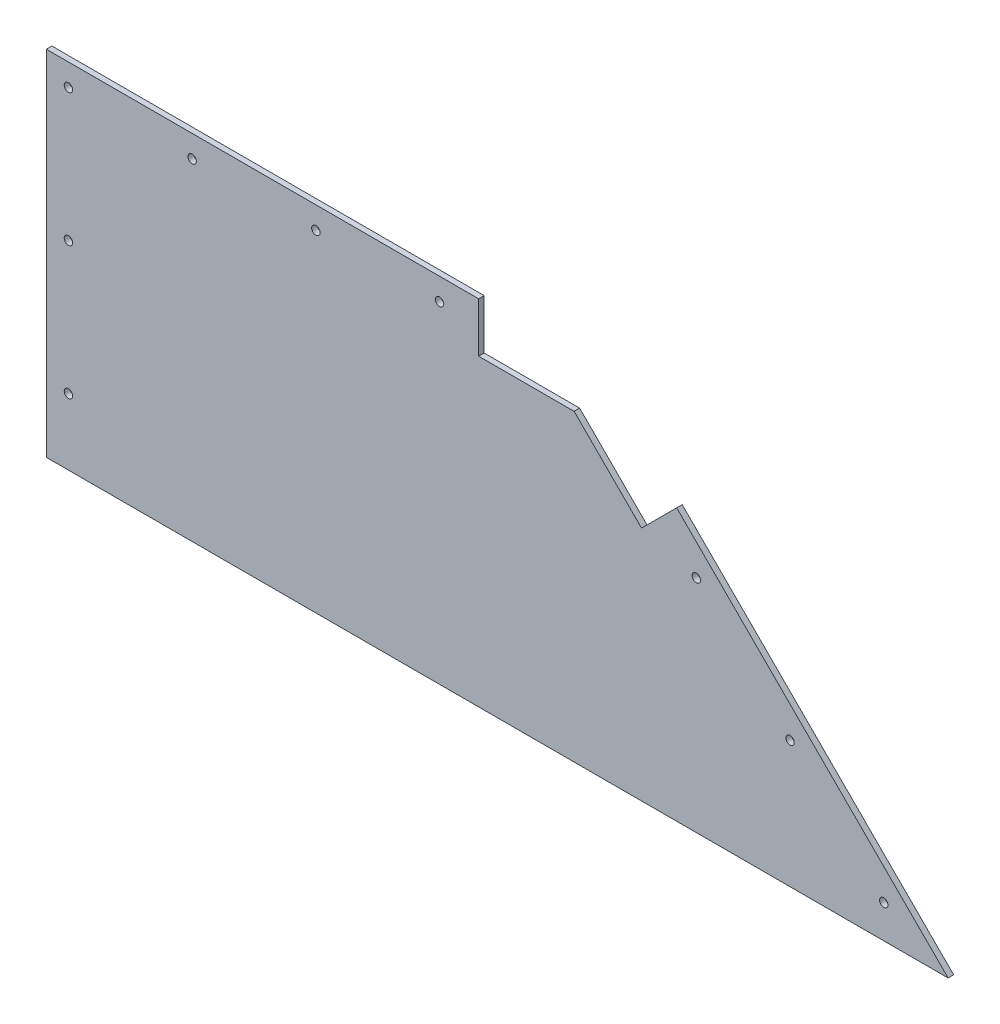
ISO-10303-21;
HEADER;
FILE_DESCRIPTION(('STEP AP214'),'2;1');
FILE_NAME('part.step','',(''),(''),'','','');
FILE_SCHEMA(('AUTOMOTIVE_DESIGN { 1 0 10303 214 1 1 1 1 }'));
ENDSEC;
DATA;
#1=APPLICATION_CONTEXT('core data for automotive mechanical design processes');
#2=APPLICATION_PROTOCOL_DEFINITION('international standard','automotive_design',2000,#1);
#3=PRODUCT_CONTEXT('',#1,'mechanical');
#4=PRODUCT('Part','Part','',(#3));
#5=PRODUCT_RELATED_PRODUCT_CATEGORY('part','',(#4));
#6=PRODUCT_DEFINITION_FORMATION('','',#4);
#7=PRODUCT_DEFINITION_CONTEXT('part definition',#1,'design');
#8=PRODUCT_DEFINITION('design','',#6,#7);
#9=PRODUCT_DEFINITION_SHAPE('','',#8);
#10=(LENGTH_UNIT() NAMED_UNIT(*) SI_UNIT(.MILLI.,.METRE.));
#11=(NAMED_UNIT(*) PLANE_ANGLE_UNIT() SI_UNIT($,.RADIAN.));
#12=(NAMED_UNIT(*) SI_UNIT($,.STERADIAN.) SOLID_ANGLE_UNIT());
#13=UNCERTAINTY_MEASURE_WITH_UNIT(LENGTH_MEASURE(1.E-05),#10,'distance_accuracy_value','');
#14=(GEOMETRIC_REPRESENTATION_CONTEXT(3) GLOBAL_UNCERTAINTY_ASSIGNED_CONTEXT((#13)) GLOBAL_UNIT_ASSIGNED_CONTEXT((#10,
#11,#12)) REPRESENTATION_CONTEXT('',''));
#15=CARTESIAN_POINT('',(0.,0.,0.));
#16=DIRECTION('',(0.,0.,1.));
#17=DIRECTION('',(1.,0.,0.));
#18=AXIS2_PLACEMENT_3D('',#15,#16,#17);
#19=CARTESIAN_POINT('',(0.,0.,3.175));
#20=DIRECTION('',(1.,0.,0.));
#21=DIRECTION('',(0.,0.,-1.));
#22=AXIS2_PLACEMENT_3D('',#19,#20,#21);
#23=PLANE('',#22);
#24=DIRECTION('',(0.,-1.,0.));
#25=VECTOR('',#24,1.);
#26=CARTESIAN_POINT('',(0.,0.,0.));
#27=LINE('',#26,#25);
#28=CARTESIAN_POINT('',(0.,203.2,0.));
#29=VERTEX_POINT('',#28);
#30=CARTESIAN_POINT('',(0.,0.,0.));
#31=VERTEX_POINT('',#30);
#32=EDGE_CURVE('E135',#29,#31,#27,.T.);
#33=ORIENTED_EDGE('',*,*,#32,.T.);
#34=DIRECTION('',(0.,0.,-1.));
#35=VECTOR('',#34,1.);
#36=CARTESIAN_POINT('',(0.,0.,3.175));
#37=LINE('',#36,#35);
#38=CARTESIAN_POINT('',(0.,0.,3.175));
#39=VERTEX_POINT('',#38);
#40=EDGE_CURVE('E11',#39,#31,#37,.T.);
#41=ORIENTED_EDGE('',*,*,#40,.F.);
#42=DIRECTION('',(0.,-1.,0.));
#43=VECTOR('',#42,1.);
#44=CARTESIAN_POINT('',(0.,0.,3.175));
#45=LINE('',#44,#43);
#46=CARTESIAN_POINT('',(0.,203.2,3.175));
#47=VERTEX_POINT('',#46);
#48=EDGE_CURVE('E133',#47,#39,#45,.T.);
#49=ORIENTED_EDGE('',*,*,#48,.F.);
#50=DIRECTION('',(0.,0.,-1.));
#51=VECTOR('',#50,1.);
#52=CARTESIAN_POINT('',(0.,203.2,3.175));
#53=LINE('',#52,#51);
#54=EDGE_CURVE('E139',#47,#29,#53,.T.);
#55=ORIENTED_EDGE('',*,*,#54,.T.);
#56=EDGE_LOOP('',(#33,#41,#49,#55));
#57=FACE_BOUND('',#56,.T.);
#58=ADVANCED_FACE('F32',(#57),#23,.F.);
#59=CARTESIAN_POINT('',(518.414000000003,0.,3.175));
#60=DIRECTION('',(0.,1.,0.));
#61=DIRECTION('',(0.,0.,1.));
#62=AXIS2_PLACEMENT_3D('',#59,#60,#61);
#63=PLANE('',#62);
#64=DIRECTION('',(1.,0.,0.));
#65=VECTOR('',#64,1.);
#66=CARTESIAN_POINT('',(518.414000000003,0.,0.));
#67=LINE('',#66,#65);
#68=CARTESIAN_POINT('',(518.414000000003,0.,0.));
#69=VERTEX_POINT('',#68);
#70=EDGE_CURVE('E131',#31,#69,#67,.T.);
#71=ORIENTED_EDGE('',*,*,#70,.T.);
#72=DIRECTION('',(0.,0.,-1.));
#73=VECTOR('',#72,1.);
#74=CARTESIAN_POINT('',(518.414000000003,0.,3.175));
#75=LINE('',#74,#73);
#76=CARTESIAN_POINT('',(518.414000000003,0.,3.175));
#77=VERTEX_POINT('',#76);
#78=EDGE_CURVE('E39',#77,#69,#75,.T.);
#79=ORIENTED_EDGE('',*,*,#78,.F.);
#80=DIRECTION('',(1.,0.,0.));
#81=VECTOR('',#80,1.);
#82=CARTESIAN_POINT('',(0.,0.,3.175));
#83=LINE('',#82,#81);
#84=EDGE_CURVE('E78',#39,#77,#83,.T.);
#85=ORIENTED_EDGE('',*,*,#84,.F.);
#86=ORIENTED_EDGE('',*,*,#40,.T.);
#87=EDGE_LOOP('',(#71,#79,#85,#86));
#88=FACE_BOUND('',#87,.T.);
#89=ADVANCED_FACE('F163',(#88),#63,.F.);
#90=CARTESIAN_POINT('',(315.214,203.2,3.175));
#91=DIRECTION('',(-0.707106781186543,-0.707106781186552,0.));
#92=DIRECTION('',(0.707106781186552,-0.707106781186543,0.));
#93=AXIS2_PLACEMENT_3D('',#90,#91,#92);
#94=PLANE('',#93);
#95=DIRECTION('',(-0.707106781186552,0.707106781186543,0.));
#96=VECTOR('',#95,1.);
#97=CARTESIAN_POINT('',(315.214,203.2,0.));
#98=LINE('',#97,#96);
#99=CARTESIAN_POINT('',(362.360344635613,156.053655364387,0.));
#100=VERTEX_POINT('',#99);
#101=EDGE_CURVE('E124',#69,#100,#98,.T.);
#102=ORIENTED_EDGE('',*,*,#101,.T.);
#103=DIRECTION('',(0.,0.,1.));
#104=VECTOR('',#103,1.);
#105=CARTESIAN_POINT('',(362.360344635615,156.053655364388,-0.00100000000000013));
#106=LINE('',#105,#104);
#107=CARTESIAN_POINT('',(362.360344635615,156.053655364388,3.175));
#108=VERTEX_POINT('',#107);
#109=EDGE_CURVE('E105',#100,#108,#106,.T.);
#110=ORIENTED_EDGE('',*,*,#109,.T.);
#111=DIRECTION('',(-0.707106781186552,0.707106781186543,0.));
#112=VECTOR('',#111,1.);
#113=CARTESIAN_POINT('',(315.214,203.2,3.175));
#114=LINE('',#113,#112);
#115=EDGE_CURVE('E144',#77,#108,#114,.T.);
#116=ORIENTED_EDGE('',*,*,#115,.F.);
#117=ORIENTED_EDGE('',*,*,#78,.T.);
#118=EDGE_LOOP('',(#102,#110,#116,#117));
#119=FACE_BOUND('',#118,.T.);
#120=ADVANCED_FACE('F130',(#119),#94,.F.);
#121=CARTESIAN_POINT('',(0.,203.2,3.175));
#122=DIRECTION('',(0.,-1.,0.));
#123=DIRECTION('',(0.,0.,-1.));
#124=AXIS2_PLACEMENT_3D('',#121,#122,#123);
#125=PLANE('',#124);
#126=DIRECTION('',(-1.,0.,0.));
#127=VECTOR('',#126,1.);
#128=CARTESIAN_POINT('',(0.,203.2,3.175));
#129=LINE('',#128,#127);
#130=CARTESIAN_POINT('',(248.539,203.2,3.175));
#131=VERTEX_POINT('',#130);
#132=EDGE_CURVE('E55',#131,#47,#129,.T.);
#133=ORIENTED_EDGE('',*,*,#132,.F.);
#134=DIRECTION('',(0.,0.,1.));
#135=VECTOR('',#134,1.);
#136=CARTESIAN_POINT('',(248.539,203.2,-0.00100000000000013));
#137=LINE('',#136,#135);
#138=CARTESIAN_POINT('',(248.539,203.2,0.));
#139=VERTEX_POINT('',#138);
#140=EDGE_CURVE('E178',#139,#131,#137,.T.);
#141=ORIENTED_EDGE('',*,*,#140,.F.);
#142=DIRECTION('',(-1.,0.,0.));
#143=VECTOR('',#142,1.);
#144=CARTESIAN_POINT('',(0.,203.2,0.));
#145=LINE('',#144,#143);
#146=EDGE_CURVE('E73',#139,#29,#145,.T.);
#147=ORIENTED_EDGE('',*,*,#146,.T.);
#148=ORIENTED_EDGE('',*,*,#54,.F.);
#149=EDGE_LOOP('',(#133,#141,#147,#148));
#150=FACE_BOUND('',#149,.T.);
#151=ADVANCED_FACE('F257',(#150),#125,.F.);
#152=CARTESIAN_POINT('',(0.,0.,3.175));
#153=DIRECTION('',(0.,0.,-1.));
#154=DIRECTION('',(-1.,0.,0.));
#155=AXIS2_PLACEMENT_3D('',#152,#153,#154);
#156=PLANE('',#155);
#157=CARTESIAN_POINT('',(481.403487757864,19.05,3.175));
#158=DIRECTION('',(0.,0.,1.));
#159=DIRECTION('',(1.,0.,0.));
#160=AXIS2_PLACEMENT_3D('',#157,#158,#159);
#161=CIRCLE('',#160,2.41300000000016);
#162=CARTESIAN_POINT('',(483.816487757864,19.05,3.175));
#163=VERTEX_POINT('',#162);
#164=EDGE_CURVE('E185',#163,#163,#161,.T.);
#165=ORIENTED_EDGE('',*,*,#164,.F.);
#166=EDGE_LOOP('',(#165));
#167=FACE_BOUND('',#166,.T.);
#168=CARTESIAN_POINT('',(427.521951031449,72.9315367264145,3.175));
#169=DIRECTION('',(0.,0.,1.));
#170=DIRECTION('',(1.,0.,0.));
#171=AXIS2_PLACEMENT_3D('',#168,#169,#170);
#172=CIRCLE('',#171,2.41299999999999);
#173=CARTESIAN_POINT('',(429.934951031449,72.9315367264145,3.175));
#174=VERTEX_POINT('',#173);
#175=EDGE_CURVE('E191',#174,#174,#172,.T.);
#176=ORIENTED_EDGE('',*,*,#175,.F.);
#177=EDGE_LOOP('',(#176));
#178=FACE_BOUND('',#177,.T.);
#179=CARTESIAN_POINT('',(373.640414305033,126.813073452829,3.175));
#180=DIRECTION('',(0.,0.,1.));
#181=DIRECTION('',(1.,0.,0.));
#182=AXIS2_PLACEMENT_3D('',#179,#180,#181);
#183=CIRCLE('',#182,2.413);
#184=CARTESIAN_POINT('',(376.053414305033,126.813073452829,3.175));
#185=VERTEX_POINT('',#184);
#186=EDGE_CURVE('E197',#185,#185,#183,.T.);
#187=ORIENTED_EDGE('',*,*,#186,.F.);
#188=EDGE_LOOP('',(#187));
#189=FACE_BOUND('',#188,.T.);
#190=CARTESIAN_POINT('',(12.7,38.1,3.175));
#191=DIRECTION('',(0.,0.,1.));
#192=DIRECTION('',(1.,0.,0.));
#193=AXIS2_PLACEMENT_3D('',#190,#191,#192);
#194=CIRCLE('',#193,2.413);
#195=CARTESIAN_POINT('',(15.113,38.1,3.175));
#196=VERTEX_POINT('',#195);
#197=EDGE_CURVE('E215',#196,#196,#194,.T.);
#198=ORIENTED_EDGE('',*,*,#197,.F.);
#199=EDGE_LOOP('',(#198));
#200=FACE_BOUND('',#199,.T.);
#201=CARTESIAN_POINT('',(83.82,190.5,3.175));
#202=DIRECTION('',(0.,0.,1.));
#203=DIRECTION('',(1.,0.,0.));
#204=AXIS2_PLACEMENT_3D('',#201,#202,#203);
#205=CIRCLE('',#204,2.413);
#206=CARTESIAN_POINT('',(86.233,190.5,3.175));
#207=VERTEX_POINT('',#206);
#208=EDGE_CURVE('E156',#207,#207,#205,.T.);
#209=ORIENTED_EDGE('',*,*,#208,.F.);
#210=EDGE_LOOP('',(#209));
#211=FACE_BOUND('',#210,.T.);
#212=CARTESIAN_POINT('',(154.94,190.5,3.175));
#213=DIRECTION('',(0.,0.,1.));
#214=DIRECTION('',(1.,0.,0.));
#215=AXIS2_PLACEMENT_3D('',#212,#213,#214);
#216=CIRCLE('',#215,2.41300000000003);
#217=CARTESIAN_POINT('',(157.353,190.5,3.175));
#218=VERTEX_POINT('',#217);
#219=EDGE_CURVE('E221',#218,#218,#216,.T.);
#220=ORIENTED_EDGE('',*,*,#219,.F.);
#221=EDGE_LOOP('',(#220));
#222=FACE_BOUND('',#221,.T.);
#223=CARTESIAN_POINT('',(226.06,190.5,3.175));
#224=DIRECTION('',(0.,0.,1.));
#225=DIRECTION('',(1.,0.,0.));
#226=AXIS2_PLACEMENT_3D('',#223,#224,#225);
#227=CIRCLE('',#226,2.41300000000003);
#228=CARTESIAN_POINT('',(228.473,190.5,3.175));
#229=VERTEX_POINT('',#228);
#230=EDGE_CURVE('E202',#229,#229,#227,.T.);
#231=ORIENTED_EDGE('',*,*,#230,.F.);
#232=EDGE_LOOP('',(#231));
#233=FACE_BOUND('',#232,.T.);
#234=CARTESIAN_POINT('',(12.7,114.3,3.175));
#235=DIRECTION('',(0.,0.,1.));
#236=DIRECTION('',(1.,0.,0.));
#237=AXIS2_PLACEMENT_3D('',#234,#235,#236);
#238=CIRCLE('',#237,2.413);
#239=CARTESIAN_POINT('',(15.113,114.3,3.175));
#240=VERTEX_POINT('',#239);
#241=EDGE_CURVE('E209',#240,#240,#238,.T.);
#242=ORIENTED_EDGE('',*,*,#241,.F.);
#243=EDGE_LOOP('',(#242));
#244=FACE_BOUND('',#243,.T.);
#245=CARTESIAN_POINT('',(12.7,190.5,3.175));
#246=DIRECTION('',(0.,0.,1.));
#247=DIRECTION('',(1.,0.,0.));
#248=AXIS2_PLACEMENT_3D('',#245,#246,#247);
#249=CIRCLE('',#248,2.413);
#250=CARTESIAN_POINT('',(15.113,190.5,3.175));
#251=VERTEX_POINT('',#250);
#252=EDGE_CURVE('E148',#251,#251,#249,.T.);
#253=ORIENTED_EDGE('',*,*,#252,.F.);
#254=EDGE_LOOP('',(#253));
#255=FACE_BOUND('',#254,.T.);
#256=ORIENTED_EDGE('',*,*,#115,.T.);
#257=DIRECTION('',(0.707106781186548,0.707106781186546,0.));
#258=VECTOR('',#257,1.);
#259=CARTESIAN_POINT('',(342.154768363209,135.848079091983,3.175));
#260=LINE('',#259,#258);
#261=CARTESIAN_POINT('',(342.154768363209,135.848079091983,3.175));
#262=VERTEX_POINT('',#261);
#263=EDGE_CURVE('E111',#262,#108,#260,.T.);
#264=ORIENTED_EDGE('',*,*,#263,.F.);
#265=DIRECTION('',(0.707106781186545,-0.70710678118655,0.));
#266=VECTOR('',#265,1.);
#267=CARTESIAN_POINT('',(303.377847455192,174.625,3.175));
#268=LINE('',#267,#266);
#269=CARTESIAN_POINT('',(303.377847455192,174.625,3.175));
#270=VERTEX_POINT('',#269);
#271=EDGE_CURVE('E175',#270,#262,#268,.T.);
#272=ORIENTED_EDGE('',*,*,#271,.F.);
#273=DIRECTION('',(1.,0.,0.));
#274=VECTOR('',#273,1.);
#275=CARTESIAN_POINT('',(248.539,174.625,3.175));
#276=LINE('',#275,#274);
#277=CARTESIAN_POINT('',(248.539,174.625,3.175));
#278=VERTEX_POINT('',#277);
#279=EDGE_CURVE('E172',#278,#270,#276,.T.);
#280=ORIENTED_EDGE('',*,*,#279,.F.);
#281=DIRECTION('',(0.,-1.,0.));
#282=VECTOR('',#281,1.);
#283=CARTESIAN_POINT('',(248.539,203.2,3.175));
#284=LINE('',#283,#282);
#285=EDGE_CURVE('E127',#131,#278,#284,.T.);
#286=ORIENTED_EDGE('',*,*,#285,.F.);
#287=ORIENTED_EDGE('',*,*,#132,.T.);
#288=ORIENTED_EDGE('',*,*,#48,.T.);
#289=ORIENTED_EDGE('',*,*,#84,.T.);
#290=EDGE_LOOP('',(#256,#264,#272,#280,#286,#287,#288,#289));
#291=FACE_BOUND('',#290,.T.);
#292=ADVANCED_FACE('F162',(#167,#178,#189,#200,#211,#222,#233,#244,#255,#291),#156,.F.);
#293=CARTESIAN_POINT('',(0.,0.,0.));
#294=DIRECTION('',(0.,0.,-1.));
#295=DIRECTION('',(-1.,0.,0.));
#296=AXIS2_PLACEMENT_3D('',#293,#294,#295);
#297=PLANE('',#296);
#298=DIRECTION('',(0.707106781186549,0.707106781186547,0.));
#299=VECTOR('',#298,1.);
#300=CARTESIAN_POINT('',(342.154768363209,135.848079091983,0.));
#301=LINE('',#300,#299);
#302=CARTESIAN_POINT('',(342.154768363209,135.848079091983,0.));
#303=VERTEX_POINT('',#302);
#304=EDGE_CURVE('E108',#303,#100,#301,.T.);
#305=ORIENTED_EDGE('',*,*,#304,.T.);
#306=ORIENTED_EDGE('',*,*,#101,.F.);
#307=ORIENTED_EDGE('',*,*,#70,.F.);
#308=ORIENTED_EDGE('',*,*,#32,.F.);
#309=ORIENTED_EDGE('',*,*,#146,.F.);
#310=DIRECTION('',(0.,-1.,0.));
#311=VECTOR('',#310,1.);
#312=CARTESIAN_POINT('',(248.539,203.2,0.));
#313=LINE('',#312,#311);
#314=CARTESIAN_POINT('',(248.539,174.625,0.));
#315=VERTEX_POINT('',#314);
#316=EDGE_CURVE('E165',#139,#315,#313,.T.);
#317=ORIENTED_EDGE('',*,*,#316,.T.);
#318=DIRECTION('',(1.,0.,0.));
#319=VECTOR('',#318,1.);
#320=CARTESIAN_POINT('',(248.539,174.625,0.));
#321=LINE('',#320,#319);
#322=CARTESIAN_POINT('',(303.377847455192,174.625,0.));
#323=VERTEX_POINT('',#322);
#324=EDGE_CURVE('E166',#315,#323,#321,.T.);
#325=ORIENTED_EDGE('',*,*,#324,.T.);
#326=DIRECTION('',(0.707106781186545,-0.70710678118655,0.));
#327=VECTOR('',#326,1.);
#328=CARTESIAN_POINT('',(303.377847455192,174.625,0.));
#329=LINE('',#328,#327);
#330=EDGE_CURVE('E126',#323,#303,#329,.T.);
#331=ORIENTED_EDGE('',*,*,#330,.T.);
#332=EDGE_LOOP('',(#305,#306,#307,#308,#309,#317,#325,#331));
#333=FACE_BOUND('',#332,.T.);
#334=CARTESIAN_POINT('',(481.403487757864,19.05,0.));
#335=DIRECTION('',(0.,0.,-1.));
#336=DIRECTION('',(-1.,0.,0.));
#337=AXIS2_PLACEMENT_3D('',#334,#335,#336);
#338=CIRCLE('',#337,2.41300000000016);
#339=CARTESIAN_POINT('',(478.990487757864,19.05,0.));
#340=VERTEX_POINT('',#339);
#341=EDGE_CURVE('E188',#340,#340,#338,.F.);
#342=ORIENTED_EDGE('',*,*,#341,.T.);
#343=EDGE_LOOP('',(#342));
#344=FACE_BOUND('',#343,.T.);
#345=CARTESIAN_POINT('',(427.521951031449,72.9315367264145,0.));
#346=DIRECTION('',(0.,0.,-1.));
#347=DIRECTION('',(-1.,0.,0.));
#348=AXIS2_PLACEMENT_3D('',#345,#346,#347);
#349=CIRCLE('',#348,2.41299999999999);
#350=CARTESIAN_POINT('',(425.108951031449,72.9315367264145,0.));
#351=VERTEX_POINT('',#350);
#352=EDGE_CURVE('E194',#351,#351,#349,.F.);
#353=ORIENTED_EDGE('',*,*,#352,.T.);
#354=EDGE_LOOP('',(#353));
#355=FACE_BOUND('',#354,.T.);
#356=CARTESIAN_POINT('',(373.640414305033,126.813073452829,0.));
#357=DIRECTION('',(0.,0.,-1.));
#358=DIRECTION('',(-1.,0.,0.));
#359=AXIS2_PLACEMENT_3D('',#356,#357,#358);
#360=CIRCLE('',#359,2.413);
#361=CARTESIAN_POINT('',(371.227414305033,126.813073452829,0.));
#362=VERTEX_POINT('',#361);
#363=EDGE_CURVE('E116',#362,#362,#360,.F.);
#364=ORIENTED_EDGE('',*,*,#363,.T.);
#365=EDGE_LOOP('',(#364));
#366=FACE_BOUND('',#365,.T.);
#367=CARTESIAN_POINT('',(12.7,38.1,0.));
#368=DIRECTION('',(0.,0.,-1.));
#369=DIRECTION('',(-1.,0.,0.));
#370=AXIS2_PLACEMENT_3D('',#367,#368,#369);
#371=CIRCLE('',#370,2.413);
#372=CARTESIAN_POINT('',(10.287,38.1,0.));
#373=VERTEX_POINT('',#372);
#374=EDGE_CURVE('E159',#373,#373,#371,.F.);
#375=ORIENTED_EDGE('',*,*,#374,.T.);
#376=EDGE_LOOP('',(#375));
#377=FACE_BOUND('',#376,.T.);
#378=CARTESIAN_POINT('',(83.82,190.5,0.));
#379=DIRECTION('',(0.,0.,-1.));
#380=DIRECTION('',(-1.,0.,0.));
#381=AXIS2_PLACEMENT_3D('',#378,#379,#380);
#382=CIRCLE('',#381,2.413);
#383=CARTESIAN_POINT('',(81.407,190.5,0.));
#384=VERTEX_POINT('',#383);
#385=EDGE_CURVE('E218',#384,#384,#382,.F.);
#386=ORIENTED_EDGE('',*,*,#385,.T.);
#387=EDGE_LOOP('',(#386));
#388=FACE_BOUND('',#387,.T.);
#389=CARTESIAN_POINT('',(154.94,190.5,0.));
#390=DIRECTION('',(0.,0.,-1.));
#391=DIRECTION('',(-1.,0.,0.));
#392=AXIS2_PLACEMENT_3D('',#389,#390,#391);
#393=CIRCLE('',#392,2.41300000000003);
#394=CARTESIAN_POINT('',(152.527,190.5,0.));
#395=VERTEX_POINT('',#394);
#396=EDGE_CURVE('E205',#395,#395,#393,.F.);
#397=ORIENTED_EDGE('',*,*,#396,.T.);
#398=EDGE_LOOP('',(#397));
#399=FACE_BOUND('',#398,.T.);
#400=CARTESIAN_POINT('',(226.06,190.5,0.));
#401=DIRECTION('',(0.,0.,-1.));
#402=DIRECTION('',(-1.,0.,0.));
#403=AXIS2_PLACEMENT_3D('',#400,#401,#402);
#404=CIRCLE('',#403,2.41300000000003);
#405=CARTESIAN_POINT('',(223.647,190.5,0.));
#406=VERTEX_POINT('',#405);
#407=EDGE_CURVE('E206',#406,#406,#404,.F.);
#408=ORIENTED_EDGE('',*,*,#407,.T.);
#409=EDGE_LOOP('',(#408));
#410=FACE_BOUND('',#409,.T.);
#411=CARTESIAN_POINT('',(12.7,114.3,0.));
#412=DIRECTION('',(0.,0.,-1.));
#413=DIRECTION('',(-1.,0.,0.));
#414=AXIS2_PLACEMENT_3D('',#411,#412,#413);
#415=CIRCLE('',#414,2.413);
#416=CARTESIAN_POINT('',(10.287,114.3,0.));
#417=VERTEX_POINT('',#416);
#418=EDGE_CURVE('E212',#417,#417,#415,.F.);
#419=ORIENTED_EDGE('',*,*,#418,.T.);
#420=EDGE_LOOP('',(#419));
#421=FACE_BOUND('',#420,.T.);
#422=CARTESIAN_POINT('',(12.7,190.5,0.));
#423=DIRECTION('',(0.,0.,-1.));
#424=DIRECTION('',(-1.,0.,0.));
#425=AXIS2_PLACEMENT_3D('',#422,#423,#424);
#426=CIRCLE('',#425,2.413);
#427=CARTESIAN_POINT('',(10.287,190.5,0.));
#428=VERTEX_POINT('',#427);
#429=EDGE_CURVE('E151',#428,#428,#426,.F.);
#430=ORIENTED_EDGE('',*,*,#429,.T.);
#431=EDGE_LOOP('',(#430));
#432=FACE_BOUND('',#431,.T.);
#433=ADVANCED_FACE('F122',(#333,#344,#355,#366,#377,#388,#399,#410,#421,#432),#297,.T.);
#434=CARTESIAN_POINT('',(12.7,190.5,-0.00100000000000013));
#435=DIRECTION('',(0.,0.,1.));
#436=DIRECTION('',(1.,0.,0.));
#437=AXIS2_PLACEMENT_3D('',#434,#435,#436);
#438=CYLINDRICAL_SURFACE('',#437,2.413);
#439=ORIENTED_EDGE('',*,*,#429,.F.);
#440=EDGE_LOOP('',(#439));
#441=FACE_BOUND('',#440,.T.);
#442=ORIENTED_EDGE('',*,*,#252,.T.);
#443=EDGE_LOOP('',(#442));
#444=FACE_BOUND('',#443,.T.);
#445=ADVANCED_FACE('F264',(#441,#444),#438,.F.);
#446=CARTESIAN_POINT('',(12.7,114.3,-0.00100000000000013));
#447=DIRECTION('',(0.,0.,1.));
#448=DIRECTION('',(1.,0.,0.));
#449=AXIS2_PLACEMENT_3D('',#446,#447,#448);
#450=CYLINDRICAL_SURFACE('',#449,2.413);
#451=ORIENTED_EDGE('',*,*,#418,.F.);
#452=EDGE_LOOP('',(#451));
#453=FACE_BOUND('',#452,.T.);
#454=ORIENTED_EDGE('',*,*,#241,.T.);
#455=EDGE_LOOP('',(#454));
#456=FACE_BOUND('',#455,.T.);
#457=ADVANCED_FACE('F268',(#453,#456),#450,.F.);
#458=CARTESIAN_POINT('',(226.06,190.5,-0.00100000000000013));
#459=DIRECTION('',(0.,0.,1.));
#460=DIRECTION('',(1.,0.,0.));
#461=AXIS2_PLACEMENT_3D('',#458,#459,#460);
#462=CYLINDRICAL_SURFACE('',#461,2.41300000000003);
#463=ORIENTED_EDGE('',*,*,#407,.F.);
#464=EDGE_LOOP('',(#463));
#465=FACE_BOUND('',#464,.T.);
#466=ORIENTED_EDGE('',*,*,#230,.T.);
#467=EDGE_LOOP('',(#466));
#468=FACE_BOUND('',#467,.T.);
#469=ADVANCED_FACE('F273',(#465,#468),#462,.F.);
#470=CARTESIAN_POINT('',(154.94,190.5,-0.00100000000000013));
#471=DIRECTION('',(0.,0.,1.));
#472=DIRECTION('',(1.,0.,0.));
#473=AXIS2_PLACEMENT_3D('',#470,#471,#472);
#474=CYLINDRICAL_SURFACE('',#473,2.41300000000003);
#475=ORIENTED_EDGE('',*,*,#396,.F.);
#476=EDGE_LOOP('',(#475));
#477=FACE_BOUND('',#476,.T.);
#478=ORIENTED_EDGE('',*,*,#219,.T.);
#479=EDGE_LOOP('',(#478));
#480=FACE_BOUND('',#479,.T.);
#481=ADVANCED_FACE('F245',(#477,#480),#474,.F.);
#482=CARTESIAN_POINT('',(83.82,190.5,-0.00100000000000013));
#483=DIRECTION('',(0.,0.,1.));
#484=DIRECTION('',(1.,0.,0.));
#485=AXIS2_PLACEMENT_3D('',#482,#483,#484);
#486=CYLINDRICAL_SURFACE('',#485,2.413);
#487=ORIENTED_EDGE('',*,*,#385,.F.);
#488=EDGE_LOOP('',(#487));
#489=FACE_BOUND('',#488,.T.);
#490=ORIENTED_EDGE('',*,*,#208,.T.);
#491=EDGE_LOOP('',(#490));
#492=FACE_BOUND('',#491,.T.);
#493=ADVANCED_FACE('F236',(#489,#492),#486,.F.);
#494=CARTESIAN_POINT('',(12.7,38.1,-0.00100000000000013));
#495=DIRECTION('',(0.,0.,1.));
#496=DIRECTION('',(1.,0.,0.));
#497=AXIS2_PLACEMENT_3D('',#494,#495,#496);
#498=CYLINDRICAL_SURFACE('',#497,2.413);
#499=ORIENTED_EDGE('',*,*,#374,.F.);
#500=EDGE_LOOP('',(#499));
#501=FACE_BOUND('',#500,.T.);
#502=ORIENTED_EDGE('',*,*,#197,.T.);
#503=EDGE_LOOP('',(#502));
#504=FACE_BOUND('',#503,.T.);
#505=ADVANCED_FACE('F233',(#501,#504),#498,.F.);
#506=CARTESIAN_POINT('',(373.640414305033,126.813073452829,-0.00100000000000013));
#507=DIRECTION('',(0.,0.,1.));
#508=DIRECTION('',(1.,0.,0.));
#509=AXIS2_PLACEMENT_3D('',#506,#507,#508);
#510=CYLINDRICAL_SURFACE('',#509,2.413);
#511=ORIENTED_EDGE('',*,*,#363,.F.);
#512=EDGE_LOOP('',(#511));
#513=FACE_BOUND('',#512,.T.);
#514=ORIENTED_EDGE('',*,*,#186,.T.);
#515=EDGE_LOOP('',(#514));
#516=FACE_BOUND('',#515,.T.);
#517=ADVANCED_FACE('F235',(#513,#516),#510,.F.);
#518=CARTESIAN_POINT('',(427.521951031449,72.9315367264145,-0.00100000000000013));
#519=DIRECTION('',(0.,0.,1.));
#520=DIRECTION('',(1.,0.,0.));
#521=AXIS2_PLACEMENT_3D('',#518,#519,#520);
#522=CYLINDRICAL_SURFACE('',#521,2.41299999999999);
#523=ORIENTED_EDGE('',*,*,#352,.F.);
#524=EDGE_LOOP('',(#523));
#525=FACE_BOUND('',#524,.T.);
#526=ORIENTED_EDGE('',*,*,#175,.T.);
#527=EDGE_LOOP('',(#526));
#528=FACE_BOUND('',#527,.T.);
#529=ADVANCED_FACE('F242',(#525,#528),#522,.F.);
#530=CARTESIAN_POINT('',(481.403487757864,19.05,-0.00100000000000013));
#531=DIRECTION('',(0.,0.,1.));
#532=DIRECTION('',(1.,0.,0.));
#533=AXIS2_PLACEMENT_3D('',#530,#531,#532);
#534=CYLINDRICAL_SURFACE('',#533,2.41300000000016);
#535=ORIENTED_EDGE('',*,*,#341,.F.);
#536=EDGE_LOOP('',(#535));
#537=FACE_BOUND('',#536,.T.);
#538=ORIENTED_EDGE('',*,*,#164,.T.);
#539=EDGE_LOOP('',(#538));
#540=FACE_BOUND('',#539,.T.);
#541=ADVANCED_FACE('F328',(#537,#540),#534,.F.);
#542=CARTESIAN_POINT('',(342.154768363209,135.848079091983,-0.00100000000000013));
#543=DIRECTION('',(0.707106781186547,-0.707106781186549,0.));
#544=DIRECTION('',(0.707106781186549,0.707106781186547,0.));
#545=AXIS2_PLACEMENT_3D('',#542,#543,#544);
#546=PLANE('',#545);
#547=DIRECTION('',(0.,0.,1.));
#548=VECTOR('',#547,1.);
#549=CARTESIAN_POINT('',(342.154768363209,135.848079091983,-0.00100000000000013));
#550=LINE('',#549,#548);
#551=EDGE_CURVE('E117',#303,#262,#550,.T.);
#552=ORIENTED_EDGE('',*,*,#551,.T.);
#553=ORIENTED_EDGE('',*,*,#263,.T.);
#554=ORIENTED_EDGE('',*,*,#109,.F.);
#555=ORIENTED_EDGE('',*,*,#304,.F.);
#556=EDGE_LOOP('',(#552,#553,#554,#555));
#557=FACE_BOUND('',#556,.T.);
#558=ADVANCED_FACE('F107',(#557),#546,.F.);
#559=CARTESIAN_POINT('',(303.377847455192,174.625,-0.00100000000000013));
#560=DIRECTION('',(-0.70710678118655,-0.707106781186545,0.));
#561=DIRECTION('',(0.707106781186545,-0.70710678118655,0.));
#562=AXIS2_PLACEMENT_3D('',#559,#560,#561);
#563=PLANE('',#562);
#564=DIRECTION('',(0.,0.,1.));
#565=VECTOR('',#564,1.);
#566=CARTESIAN_POINT('',(303.377847455192,174.625,-0.00100000000000013));
#567=LINE('',#566,#565);
#568=EDGE_CURVE('E181',#323,#270,#567,.T.);
#569=ORIENTED_EDGE('',*,*,#568,.T.);
#570=ORIENTED_EDGE('',*,*,#271,.T.);
#571=ORIENTED_EDGE('',*,*,#551,.F.);
#572=ORIENTED_EDGE('',*,*,#330,.F.);
#573=EDGE_LOOP('',(#569,#570,#571,#572));
#574=FACE_BOUND('',#573,.T.);
#575=ADVANCED_FACE('F373',(#574),#563,.F.);
#576=CARTESIAN_POINT('',(248.539,174.625,-0.00100000000000013));
#577=DIRECTION('',(0.,-1.,0.));
#578=DIRECTION('',(0.,0.,-1.));
#579=AXIS2_PLACEMENT_3D('',#576,#577,#578);
#580=PLANE('',#579);
#581=DIRECTION('',(0.,0.,1.));
#582=VECTOR('',#581,1.);
#583=CARTESIAN_POINT('',(248.539,174.625,-0.00100000000000013));
#584=LINE('',#583,#582);
#585=EDGE_CURVE('E46',#315,#278,#584,.T.);
#586=ORIENTED_EDGE('',*,*,#585,.T.);
#587=ORIENTED_EDGE('',*,*,#279,.T.);
#588=ORIENTED_EDGE('',*,*,#568,.F.);
#589=ORIENTED_EDGE('',*,*,#324,.F.);
#590=EDGE_LOOP('',(#586,#587,#588,#589));
#591=FACE_BOUND('',#590,.T.);
#592=ADVANCED_FACE('F382',(#591),#580,.F.);
#593=CARTESIAN_POINT('',(248.539,203.2,-0.00100000000000013));
#594=DIRECTION('',(-1.,0.,0.));
#595=DIRECTION('',(0.,-1.,0.));
#596=AXIS2_PLACEMENT_3D('',#593,#594,#595);
#597=PLANE('',#596);
#598=ORIENTED_EDGE('',*,*,#140,.T.);
#599=ORIENTED_EDGE('',*,*,#285,.T.);
#600=ORIENTED_EDGE('',*,*,#585,.F.);
#601=ORIENTED_EDGE('',*,*,#316,.F.);
#602=EDGE_LOOP('',(#598,#599,#600,#601));
#603=FACE_BOUND('',#602,.T.);
#604=ADVANCED_FACE('F392',(#603),#597,.F.);
#605=CLOSED_SHELL('',(#58,#89,#120,#151,#292,#433,#445,#457,#469,#481,#493,#505,#517,#529,#541,
#558,#575,#592,#604));
#606=MANIFOLD_SOLID_BREP('B2',#605);
#607=ADVANCED_BREP_SHAPE_REPRESENTATION('',(#18,#606),#14);
#608=SHAPE_DEFINITION_REPRESENTATION(#9,#607);
ENDSEC;
END-ISO-10303-21;
